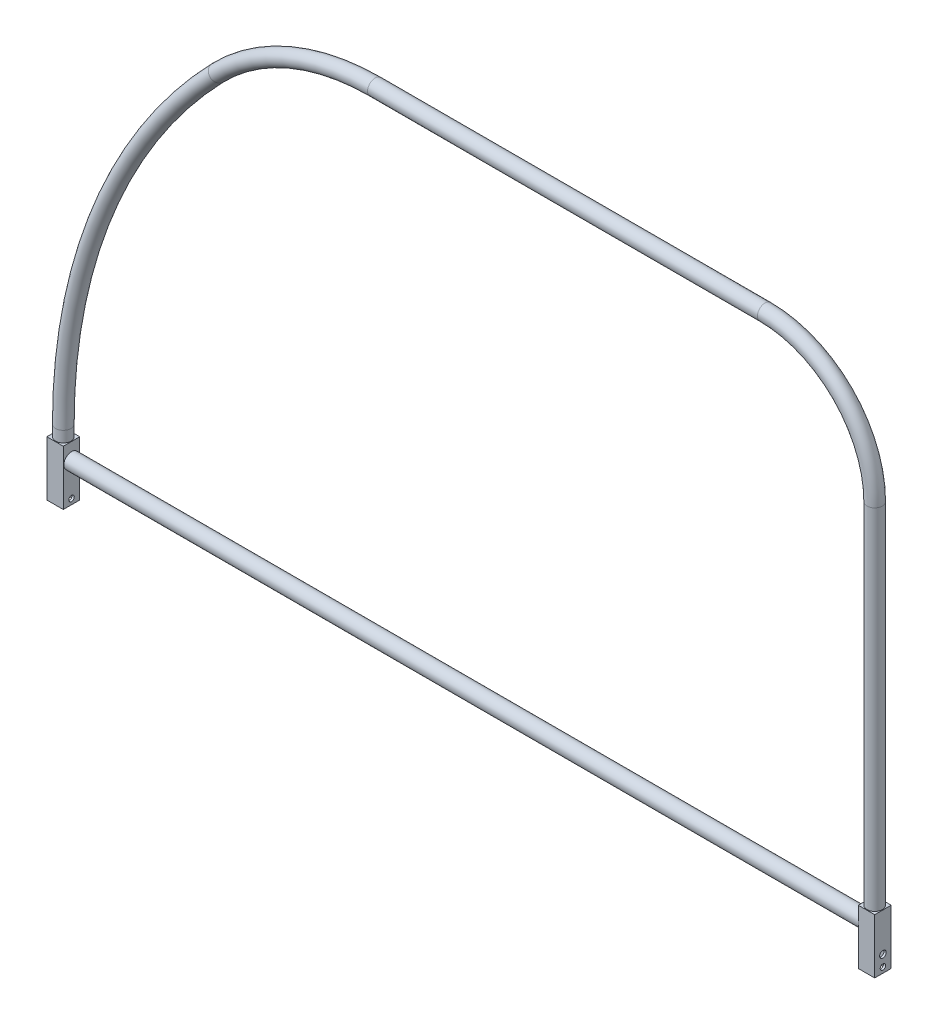
ISO-10303-21;
HEADER;
FILE_DESCRIPTION(('STEP AP214'),'2;1');
FILE_NAME('part.step','',(''),(''),'','','');
FILE_SCHEMA(('AUTOMOTIVE_DESIGN { 1 0 10303 214 1 1 1 1 }'));
ENDSEC;
DATA;
#1=APPLICATION_CONTEXT('core data for automotive mechanical design processes');
#2=APPLICATION_PROTOCOL_DEFINITION('international standard','automotive_design',2000,#1);
#3=PRODUCT_CONTEXT('',#1,'mechanical');
#4=PRODUCT('Part','Part','',(#3));
#5=PRODUCT_RELATED_PRODUCT_CATEGORY('part','',(#4));
#6=PRODUCT_DEFINITION_FORMATION('','',#4);
#7=PRODUCT_DEFINITION_CONTEXT('part definition',#1,'design');
#8=PRODUCT_DEFINITION('design','',#6,#7);
#9=PRODUCT_DEFINITION_SHAPE('','',#8);
#10=(LENGTH_UNIT() NAMED_UNIT(*) SI_UNIT(.MILLI.,.METRE.));
#11=(NAMED_UNIT(*) PLANE_ANGLE_UNIT() SI_UNIT($,.RADIAN.));
#12=(NAMED_UNIT(*) SI_UNIT($,.STERADIAN.) SOLID_ANGLE_UNIT());
#13=UNCERTAINTY_MEASURE_WITH_UNIT(LENGTH_MEASURE(1.E-05),#10,'distance_accuracy_value','');
#14=(GEOMETRIC_REPRESENTATION_CONTEXT(3) GLOBAL_UNCERTAINTY_ASSIGNED_CONTEXT((#13)) GLOBAL_UNIT_ASSIGNED_CONTEXT((#10,
#11,#12)) REPRESENTATION_CONTEXT('',''));
#15=CARTESIAN_POINT('',(0.,0.,0.));
#16=DIRECTION('',(0.,0.,1.));
#17=DIRECTION('',(1.,0.,0.));
#18=AXIS2_PLACEMENT_3D('',#15,#16,#17);
#19=CARTESIAN_POINT('',(0.,-63.5,0.));
#20=DIRECTION('',(0.,1.,0.));
#21=DIRECTION('',(0.,0.,1.));
#22=AXIS2_PLACEMENT_3D('',#19,#20,#21);
#23=PLANE('',#22);
#24=DIRECTION('',(0.,0.,-1.));
#25=VECTOR('',#24,1.);
#26=CARTESIAN_POINT('',(-9.525,-63.5,9.525));
#27=LINE('',#26,#25);
#28=CARTESIAN_POINT('',(-9.525,-63.5,9.525));
#29=VERTEX_POINT('',#28);
#30=CARTESIAN_POINT('',(-9.525,-63.5,-9.525));
#31=VERTEX_POINT('',#30);
#32=EDGE_CURVE('E335',#29,#31,#27,.T.);
#33=ORIENTED_EDGE('',*,*,#32,.T.);
#34=DIRECTION('',(1.,0.,0.));
#35=VECTOR('',#34,1.);
#36=CARTESIAN_POINT('',(9.525,-63.5,-9.525));
#37=LINE('',#36,#35);
#38=CARTESIAN_POINT('',(9.525,-63.5,-9.525));
#39=VERTEX_POINT('',#38);
#40=EDGE_CURVE('E339',#31,#39,#37,.T.);
#41=ORIENTED_EDGE('',*,*,#40,.T.);
#42=DIRECTION('',(0.,0.,1.));
#43=VECTOR('',#42,1.);
#44=CARTESIAN_POINT('',(9.525,-63.5,9.525));
#45=LINE('',#44,#43);
#46=CARTESIAN_POINT('',(9.525,-63.5,9.525));
#47=VERTEX_POINT('',#46);
#48=EDGE_CURVE('E343',#39,#47,#45,.T.);
#49=ORIENTED_EDGE('',*,*,#48,.T.);
#50=DIRECTION('',(-1.,0.,0.));
#51=VECTOR('',#50,1.);
#52=CARTESIAN_POINT('',(9.525,-63.5,9.525));
#53=LINE('',#52,#51);
#54=EDGE_CURVE('E346',#47,#29,#53,.T.);
#55=ORIENTED_EDGE('',*,*,#54,.T.);
#56=EDGE_LOOP('',(#33,#41,#49,#55));
#57=FACE_BOUND('',#56,.T.);
#58=DIRECTION('',(0.,0.,-1.));
#59=VECTOR('',#58,1.);
#60=CARTESIAN_POINT('',(-6.985,-63.5,0.));
#61=LINE('',#60,#59);
#62=CARTESIAN_POINT('',(-6.985,-63.5,6.985));
#63=VERTEX_POINT('',#62);
#64=CARTESIAN_POINT('',(-6.985,-63.5,-6.985));
#65=VERTEX_POINT('',#64);
#66=EDGE_CURVE('E268',#63,#65,#61,.T.);
#67=ORIENTED_EDGE('',*,*,#66,.F.);
#68=DIRECTION('',(-1.,0.,0.));
#69=VECTOR('',#68,1.);
#70=CARTESIAN_POINT('',(0.,-63.5,6.985));
#71=LINE('',#70,#69);
#72=CARTESIAN_POINT('',(6.985,-63.5,6.985));
#73=VERTEX_POINT('',#72);
#74=EDGE_CURVE('E265',#73,#63,#71,.T.);
#75=ORIENTED_EDGE('',*,*,#74,.F.);
#76=DIRECTION('',(0.,0.,1.));
#77=VECTOR('',#76,1.);
#78=CARTESIAN_POINT('',(6.985,-63.5,0.));
#79=LINE('',#78,#77);
#80=CARTESIAN_POINT('',(6.985,-63.5,-6.985));
#81=VERTEX_POINT('',#80);
#82=EDGE_CURVE('E279',#81,#73,#79,.T.);
#83=ORIENTED_EDGE('',*,*,#82,.F.);
#84=DIRECTION('',(1.,0.,0.));
#85=VECTOR('',#84,1.);
#86=CARTESIAN_POINT('',(0.,-63.5,-6.985));
#87=LINE('',#86,#85);
#88=EDGE_CURVE('E282',#65,#81,#87,.T.);
#89=ORIENTED_EDGE('',*,*,#88,.F.);
#90=EDGE_LOOP('',(#67,#75,#83,#89));
#91=FACE_BOUND('',#90,.T.);
#92=ADVANCED_FACE('F68',(#57,#91),#23,.F.);
#93=CARTESIAN_POINT('',(0.,-63.5,0.));
#94=DIRECTION('',(0.,1.,0.));
#95=DIRECTION('',(0.,0.,1.));
#96=AXIS2_PLACEMENT_3D('',#93,#94,#95);
#97=PLANE('',#96);
#98=DIRECTION('',(0.,0.,-1.));
#99=VECTOR('',#98,1.);
#100=CARTESIAN_POINT('',(930.275,-63.5,9.52500000000001));
#101=LINE('',#100,#99);
#102=CARTESIAN_POINT('',(930.275,-63.5,9.52500000000001));
#103=VERTEX_POINT('',#102);
#104=CARTESIAN_POINT('',(930.275,-63.5,-9.52500000000001));
#105=VERTEX_POINT('',#104);
#106=EDGE_CURVE('E293',#103,#105,#101,.T.);
#107=ORIENTED_EDGE('',*,*,#106,.T.);
#108=DIRECTION('',(1.,0.,0.));
#109=VECTOR('',#108,1.);
#110=CARTESIAN_POINT('',(949.325,-63.5,-9.525));
#111=LINE('',#110,#109);
#112=CARTESIAN_POINT('',(949.325,-63.5,-9.525));
#113=VERTEX_POINT('',#112);
#114=EDGE_CURVE('E297',#105,#113,#111,.T.);
#115=ORIENTED_EDGE('',*,*,#114,.T.);
#116=DIRECTION('',(0.,0.,1.));
#117=VECTOR('',#116,1.);
#118=CARTESIAN_POINT('',(949.325,-63.5,9.52500000000001));
#119=LINE('',#118,#117);
#120=CARTESIAN_POINT('',(949.325,-63.5,9.52500000000001));
#121=VERTEX_POINT('',#120);
#122=EDGE_CURVE('E301',#113,#121,#119,.T.);
#123=ORIENTED_EDGE('',*,*,#122,.T.);
#124=DIRECTION('',(-1.,0.,0.));
#125=VECTOR('',#124,1.);
#126=CARTESIAN_POINT('',(949.325,-63.5,9.52500000000001));
#127=LINE('',#126,#125);
#128=EDGE_CURVE('E304',#121,#103,#127,.T.);
#129=ORIENTED_EDGE('',*,*,#128,.T.);
#130=EDGE_LOOP('',(#107,#115,#123,#129));
#131=FACE_BOUND('',#130,.T.);
#132=DIRECTION('',(0.,0.,-1.));
#133=VECTOR('',#132,1.);
#134=CARTESIAN_POINT('',(932.815,-63.5,0.));
#135=LINE('',#134,#133);
#136=CARTESIAN_POINT('',(932.815,-63.5,6.985));
#137=VERTEX_POINT('',#136);
#138=CARTESIAN_POINT('',(932.815,-63.5,-6.985));
#139=VERTEX_POINT('',#138);
#140=EDGE_CURVE('E193',#137,#139,#135,.T.);
#141=ORIENTED_EDGE('',*,*,#140,.F.);
#142=DIRECTION('',(-1.,0.,0.));
#143=VECTOR('',#142,1.);
#144=CARTESIAN_POINT('',(0.,-63.5,6.98499999999992));
#145=LINE('',#144,#143);
#146=CARTESIAN_POINT('',(946.785,-63.5,6.98500000000001));
#147=VERTEX_POINT('',#146);
#148=EDGE_CURVE('E199',#147,#137,#145,.T.);
#149=ORIENTED_EDGE('',*,*,#148,.F.);
#150=DIRECTION('',(0.,0.,1.));
#151=VECTOR('',#150,1.);
#152=CARTESIAN_POINT('',(946.785,-63.5,0.));
#153=LINE('',#152,#151);
#154=CARTESIAN_POINT('',(946.785,-63.5,-6.985));
#155=VERTEX_POINT('',#154);
#156=EDGE_CURVE('E274',#155,#147,#153,.T.);
#157=ORIENTED_EDGE('',*,*,#156,.F.);
#158=DIRECTION('',(1.,0.,0.));
#159=VECTOR('',#158,1.);
#160=CARTESIAN_POINT('',(0.,-63.5,-6.98500000000009));
#161=LINE('',#160,#159);
#162=EDGE_CURVE('E271',#139,#155,#161,.T.);
#163=ORIENTED_EDGE('',*,*,#162,.F.);
#164=EDGE_LOOP('',(#141,#149,#157,#163));
#165=FACE_BOUND('',#164,.T.);
#166=ADVANCED_FACE('F430',(#131,#165),#97,.F.);
#167=CARTESIAN_POINT('',(0.,0.,0.));
#168=DIRECTION('',(0.,1.,0.));
#169=DIRECTION('',(0.,0.,1.));
#170=AXIS2_PLACEMENT_3D('',#167,#168,#169);
#171=CYLINDRICAL_SURFACE('',#170,8.88999999999995);
#172=CARTESIAN_POINT('',(0.,12.7,0.));
#173=DIRECTION('',(0.,-1.,0.));
#174=DIRECTION('',(0.,0.,1.));
#175=AXIS2_PLACEMENT_3D('',#172,#173,#174);
#176=CIRCLE('',#175,8.88999999999995);
#177=CARTESIAN_POINT('',(-8.88999999999984,12.7,0.));
#178=VERTEX_POINT('',#177);
#179=EDGE_CURVE('E381',#178,#178,#176,.T.);
#180=ORIENTED_EDGE('',*,*,#179,.T.);
#181=EDGE_LOOP('',(#180));
#182=FACE_BOUND('',#181,.T.);
#183=CARTESIAN_POINT('',(0.,0.,0.));
#184=DIRECTION('',(0.,-1.,0.));
#185=DIRECTION('',(0.,0.,1.));
#186=AXIS2_PLACEMENT_3D('',#183,#184,#185);
#187=CIRCLE('',#186,8.88999999999995);
#188=CARTESIAN_POINT('',(0.,0.,8.88999999999995));
#189=VERTEX_POINT('',#188);
#190=EDGE_CURVE('E377',#189,#189,#187,.T.);
#191=ORIENTED_EDGE('',*,*,#190,.F.);
#192=EDGE_LOOP('',(#191));
#193=FACE_BOUND('',#192,.T.);
#194=ADVANCED_FACE('F433',(#182,#193),#171,.T.);
#195=CARTESIAN_POINT('',(635.,12.7,0.));
#196=DIRECTION('',(0.,0.,-1.));
#197=DIRECTION('',(-1.,0.,0.));
#198=AXIS2_PLACEMENT_3D('',#195,#196,#197);
#199=TOROIDAL_SURFACE('',#198,635.,8.88999999999995);
#200=CARTESIAN_POINT('',(178.877192157063,454.488392972785,0.));
#201=DIRECTION('',(-0.695729752713046,-0.718303634398325,0.));
#202=DIRECTION('',(0.,0.,1.));
#203=AXIS2_PLACEMENT_3D('',#200,#201,#202);
#204=CIRCLE('',#203,8.88999999999995);
#205=CARTESIAN_POINT('',(172.491472847262,460.673430474403,0.));
#206=VERTEX_POINT('',#205);
#207=EDGE_CURVE('E385',#206,#206,#204,.T.);
#208=CARTESIAN_POINT('',(635.,12.7,0.));
#209=DIRECTION('',(0.,0.,-1.));
#210=DIRECTION('',(-1.,0.,0.));
#211=AXIS2_PLACEMENT_3D('',#208,#209,#210);
#212=CIRCLE('',#211,643.89);
#213=EDGE_CURVE('',#178,#206,#212,.T.);
#214=ORIENTED_EDGE('',*,*,#179,.F.);
#215=ORIENTED_EDGE('',*,*,#207,.T.);
#216=ORIENTED_EDGE('',*,*,#213,.T.);
#217=ORIENTED_EDGE('',*,*,#213,.F.);
#218=EDGE_LOOP('',(#214,#216,#215,#217));
#219=FACE_BOUND('',#218,.T.);
#220=ADVANCED_FACE('F484',(#219),#199,.T.);
#221=CARTESIAN_POINT('',(361.326315294238,277.773035783671,0.));
#222=DIRECTION('',(0.,0.,-1.));
#223=DIRECTION('',(-1.,0.,0.));
#224=AXIS2_PLACEMENT_3D('',#221,#222,#223);
#225=TOROIDAL_SURFACE('',#224,254.,8.88999999999995);
#226=CARTESIAN_POINT('',(361.326315294238,531.773035783671,0.));
#227=DIRECTION('',(-1.,0.,0.));
#228=DIRECTION('',(0.,0.,1.));
#229=AXIS2_PLACEMENT_3D('',#226,#227,#228);
#230=CIRCLE('',#229,8.88999999999995);
#231=CARTESIAN_POINT('',(361.326315294238,540.663035783671,0.));
#232=VERTEX_POINT('',#231);
#233=EDGE_CURVE('E389',#232,#232,#230,.T.);
#234=CARTESIAN_POINT('',(361.326315294238,277.773035783671,0.));
#235=DIRECTION('',(0.,0.,-1.));
#236=DIRECTION('',(-1.,0.,0.));
#237=AXIS2_PLACEMENT_3D('',#234,#235,#236);
#238=CIRCLE('',#237,262.89);
#239=EDGE_CURVE('',#206,#232,#238,.T.);
#240=ORIENTED_EDGE('',*,*,#207,.F.);
#241=ORIENTED_EDGE('',*,*,#233,.T.);
#242=ORIENTED_EDGE('',*,*,#239,.T.);
#243=ORIENTED_EDGE('',*,*,#239,.F.);
#244=EDGE_LOOP('',(#240,#242,#241,#243));
#245=FACE_BOUND('',#244,.T.);
#246=ADVANCED_FACE('F488',(#245),#225,.T.);
#247=CARTESIAN_POINT('',(361.326315294238,531.773035783671,0.));
#248=DIRECTION('',(1.,0.,0.));
#249=DIRECTION('',(0.,0.,-1.));
#250=AXIS2_PLACEMENT_3D('',#247,#248,#249);
#251=CYLINDRICAL_SURFACE('',#250,8.88999999999995);
#252=CARTESIAN_POINT('',(812.8,531.773035783671,0.));
#253=DIRECTION('',(-1.,0.,0.));
#254=DIRECTION('',(0.,0.,1.));
#255=AXIS2_PLACEMENT_3D('',#252,#253,#254);
#256=CIRCLE('',#255,8.88999999999995);
#257=CARTESIAN_POINT('',(812.8,540.663035783671,0.));
#258=VERTEX_POINT('',#257);
#259=EDGE_CURVE('E393',#258,#258,#256,.T.);
#260=ORIENTED_EDGE('',*,*,#259,.T.);
#261=EDGE_LOOP('',(#260));
#262=FACE_BOUND('',#261,.T.);
#263=ORIENTED_EDGE('',*,*,#233,.F.);
#264=EDGE_LOOP('',(#263));
#265=FACE_BOUND('',#264,.T.);
#266=ADVANCED_FACE('F492',(#262,#265),#251,.T.);
#267=CARTESIAN_POINT('',(812.8,404.773035783671,0.));
#268=DIRECTION('',(0.,0.,-1.));
#269=DIRECTION('',(-1.,0.,0.));
#270=AXIS2_PLACEMENT_3D('',#267,#268,#269);
#271=TOROIDAL_SURFACE('',#270,127.,8.88999999999995);
#272=CARTESIAN_POINT('',(939.8,404.773035783671,0.));
#273=DIRECTION('',(0.,1.,0.));
#274=DIRECTION('',(0.,0.,1.));
#275=AXIS2_PLACEMENT_3D('',#272,#273,#274);
#276=CIRCLE('',#275,8.88999999999995);
#277=CARTESIAN_POINT('',(948.69,404.773035783671,0.));
#278=VERTEX_POINT('',#277);
#279=EDGE_CURVE('E78',#278,#278,#276,.T.);
#280=CARTESIAN_POINT('',(812.8,404.773035783671,0.));
#281=DIRECTION('',(0.,0.,-1.));
#282=DIRECTION('',(-1.,0.,0.));
#283=AXIS2_PLACEMENT_3D('',#280,#281,#282);
#284=CIRCLE('',#283,135.89);
#285=EDGE_CURVE('',#258,#278,#284,.T.);
#286=ORIENTED_EDGE('',*,*,#259,.F.);
#287=ORIENTED_EDGE('',*,*,#279,.T.);
#288=ORIENTED_EDGE('',*,*,#285,.T.);
#289=ORIENTED_EDGE('',*,*,#285,.F.);
#290=EDGE_LOOP('',(#286,#288,#287,#289));
#291=FACE_BOUND('',#290,.T.);
#292=ADVANCED_FACE('F495',(#291),#271,.T.);
#293=CARTESIAN_POINT('',(939.8,404.773035783671,0.));
#294=DIRECTION('',(0.,-1.,0.));
#295=DIRECTION('',(0.,0.,-1.));
#296=AXIS2_PLACEMENT_3D('',#293,#294,#295);
#297=CYLINDRICAL_SURFACE('',#296,8.88999999999995);
#298=CARTESIAN_POINT('',(939.8,0.,0.));
#299=DIRECTION('',(0.,1.,0.));
#300=DIRECTION('',(0.,0.,1.));
#301=AXIS2_PLACEMENT_3D('',#298,#299,#300);
#302=CIRCLE('',#301,8.88999999999995);
#303=CARTESIAN_POINT('',(939.8,0.,8.88999999999995));
#304=VERTEX_POINT('',#303);
#305=EDGE_CURVE('E334',#304,#304,#302,.T.);
#306=ORIENTED_EDGE('',*,*,#305,.T.);
#307=EDGE_LOOP('',(#306));
#308=FACE_BOUND('',#307,.T.);
#309=ORIENTED_EDGE('',*,*,#279,.F.);
#310=EDGE_LOOP('',(#309));
#311=FACE_BOUND('',#310,.T.);
#312=ADVANCED_FACE('F70',(#308,#311),#297,.T.);
#313=CARTESIAN_POINT('',(-9.525,-63.5,9.525));
#314=DIRECTION('',(1.,0.,0.));
#315=DIRECTION('',(0.,0.,-1.));
#316=AXIS2_PLACEMENT_3D('',#313,#314,#315);
#317=PLANE('',#316);
#318=CARTESIAN_POINT('',(-9.525,-44.45,0.));
#319=DIRECTION('',(-1.,0.,0.));
#320=DIRECTION('',(0.,0.,1.));
#321=AXIS2_PLACEMENT_3D('',#318,#319,#320);
#322=CIRCLE('',#321,3.81);
#323=CARTESIAN_POINT('',(-9.525,-44.45,3.81));
#324=VERTEX_POINT('',#323);
#325=EDGE_CURVE('E947',#324,#324,#322,.T.);
#326=ORIENTED_EDGE('',*,*,#325,.F.);
#327=EDGE_LOOP('',(#326));
#328=FACE_BOUND('',#327,.T.);
#329=CARTESIAN_POINT('',(-9.525,-57.15,0.));
#330=DIRECTION('',(-1.,0.,0.));
#331=DIRECTION('',(0.,0.,1.));
#332=AXIS2_PLACEMENT_3D('',#329,#330,#331);
#333=CIRCLE('',#332,3.175);
#334=CARTESIAN_POINT('',(-9.525,-57.15,3.17499999999999));
#335=VERTEX_POINT('',#334);
#336=EDGE_CURVE('E958',#335,#335,#333,.T.);
#337=ORIENTED_EDGE('',*,*,#336,.F.);
#338=EDGE_LOOP('',(#337));
#339=FACE_BOUND('',#338,.T.);
#340=DIRECTION('',(0.,0.,-1.));
#341=VECTOR('',#340,1.);
#342=CARTESIAN_POINT('',(-9.525,0.,9.525));
#343=LINE('',#342,#341);
#344=CARTESIAN_POINT('',(-9.525,0.,9.525));
#345=VERTEX_POINT('',#344);
#346=CARTESIAN_POINT('',(-9.525,0.,-9.525));
#347=VERTEX_POINT('',#346);
#348=EDGE_CURVE('E350',#345,#347,#343,.T.);
#349=ORIENTED_EDGE('',*,*,#348,.T.);
#350=DIRECTION('',(0.,1.,0.));
#351=VECTOR('',#350,1.);
#352=CARTESIAN_POINT('',(-9.525,-63.5,-9.525));
#353=LINE('',#352,#351);
#354=EDGE_CURVE('E373',#31,#347,#353,.T.);
#355=ORIENTED_EDGE('',*,*,#354,.F.);
#356=ORIENTED_EDGE('',*,*,#32,.F.);
#357=DIRECTION('',(0.,1.,0.));
#358=VECTOR('',#357,1.);
#359=CARTESIAN_POINT('',(-9.525,-63.5,9.525));
#360=LINE('',#359,#358);
#361=EDGE_CURVE('E349',#29,#345,#360,.T.);
#362=ORIENTED_EDGE('',*,*,#361,.T.);
#363=EDGE_LOOP('',(#349,#355,#356,#362));
#364=FACE_BOUND('',#363,.T.);
#365=ADVANCED_FACE('F477',(#328,#339,#364),#317,.F.);
#366=CARTESIAN_POINT('',(9.525,-63.5,-9.525));
#367=DIRECTION('',(0.,0.,1.));
#368=DIRECTION('',(1.,0.,0.));
#369=AXIS2_PLACEMENT_3D('',#366,#367,#368);
#370=PLANE('',#369);
#371=DIRECTION('',(1.,0.,0.));
#372=VECTOR('',#371,1.);
#373=CARTESIAN_POINT('',(9.525,0.,-9.525));
#374=LINE('',#373,#372);
#375=CARTESIAN_POINT('',(9.525,0.,-9.525));
#376=VERTEX_POINT('',#375);
#377=EDGE_CURVE('E354',#347,#376,#374,.T.);
#378=ORIENTED_EDGE('',*,*,#377,.T.);
#379=DIRECTION('',(0.,1.,0.));
#380=VECTOR('',#379,1.);
#381=CARTESIAN_POINT('',(9.525,-63.5,-9.525));
#382=LINE('',#381,#380);
#383=EDGE_CURVE('E369',#39,#376,#382,.T.);
#384=ORIENTED_EDGE('',*,*,#383,.F.);
#385=ORIENTED_EDGE('',*,*,#40,.F.);
#386=ORIENTED_EDGE('',*,*,#354,.T.);
#387=EDGE_LOOP('',(#378,#384,#385,#386));
#388=FACE_BOUND('',#387,.T.);
#389=ADVANCED_FACE('F473',(#388),#370,.F.);
#390=CARTESIAN_POINT('',(9.525,-63.5,9.525));
#391=DIRECTION('',(-1.,0.,0.));
#392=DIRECTION('',(0.,0.,1.));
#393=AXIS2_PLACEMENT_3D('',#390,#391,#392);
#394=PLANE('',#393);
#395=CARTESIAN_POINT('',(9.52500000000001,-57.15,0.));
#396=DIRECTION('',(-1.,0.,0.));
#397=DIRECTION('',(0.,0.,1.));
#398=AXIS2_PLACEMENT_3D('',#395,#396,#397);
#399=CIRCLE('',#398,3.175);
#400=CARTESIAN_POINT('',(9.52500000000001,-57.15,3.175));
#401=VERTEX_POINT('',#400);
#402=EDGE_CURVE('E217',#401,#401,#399,.T.);
#403=ORIENTED_EDGE('',*,*,#402,.T.);
#404=EDGE_LOOP('',(#403));
#405=FACE_BOUND('',#404,.T.);
#406=CARTESIAN_POINT('',(9.525,-19.05,0.));
#407=DIRECTION('',(1.,0.,0.));
#408=DIRECTION('',(0.,0.,-1.));
#409=AXIS2_PLACEMENT_3D('',#406,#407,#408);
#410=CIRCLE('',#409,8.89);
#411=CARTESIAN_POINT('',(9.525,-19.05,-8.89));
#412=VERTEX_POINT('',#411);
#413=EDGE_CURVE('E14',#412,#412,#410,.T.);
#414=ORIENTED_EDGE('',*,*,#413,.F.);
#415=EDGE_LOOP('',(#414));
#416=FACE_BOUND('',#415,.T.);
#417=DIRECTION('',(0.,0.,1.));
#418=VECTOR('',#417,1.);
#419=CARTESIAN_POINT('',(9.525,0.,9.525));
#420=LINE('',#419,#418);
#421=CARTESIAN_POINT('',(9.525,0.,9.525));
#422=VERTEX_POINT('',#421);
#423=EDGE_CURVE('E357',#376,#422,#420,.T.);
#424=ORIENTED_EDGE('',*,*,#423,.T.);
#425=DIRECTION('',(0.,1.,0.));
#426=VECTOR('',#425,1.);
#427=CARTESIAN_POINT('',(9.525,-63.5,9.525));
#428=LINE('',#427,#426);
#429=EDGE_CURVE('E365',#47,#422,#428,.T.);
#430=ORIENTED_EDGE('',*,*,#429,.F.);
#431=ORIENTED_EDGE('',*,*,#48,.F.);
#432=ORIENTED_EDGE('',*,*,#383,.T.);
#433=EDGE_LOOP('',(#424,#430,#431,#432));
#434=FACE_BOUND('',#433,.T.);
#435=ADVANCED_FACE('F469',(#405,#416,#434),#394,.F.);
#436=CARTESIAN_POINT('',(9.525,-63.5,9.525));
#437=DIRECTION('',(0.,0.,-1.));
#438=DIRECTION('',(-1.,0.,0.));
#439=AXIS2_PLACEMENT_3D('',#436,#437,#438);
#440=PLANE('',#439);
#441=DIRECTION('',(-1.,0.,0.));
#442=VECTOR('',#441,1.);
#443=CARTESIAN_POINT('',(9.525,0.,9.525));
#444=LINE('',#443,#442);
#445=EDGE_CURVE('E340',#422,#345,#444,.T.);
#446=ORIENTED_EDGE('',*,*,#445,.T.);
#447=ORIENTED_EDGE('',*,*,#361,.F.);
#448=ORIENTED_EDGE('',*,*,#54,.F.);
#449=ORIENTED_EDGE('',*,*,#429,.T.);
#450=EDGE_LOOP('',(#446,#447,#448,#449));
#451=FACE_BOUND('',#450,.T.);
#452=ADVANCED_FACE('F465',(#451),#440,.F.);
#453=CARTESIAN_POINT('',(0.,0.,0.));
#454=DIRECTION('',(0.,1.,0.));
#455=DIRECTION('',(0.,0.,1.));
#456=AXIS2_PLACEMENT_3D('',#453,#454,#455);
#457=PLANE('',#456);
#458=ORIENTED_EDGE('',*,*,#190,.T.);
#459=EDGE_LOOP('',(#458));
#460=FACE_BOUND('',#459,.T.);
#461=ORIENTED_EDGE('',*,*,#348,.F.);
#462=ORIENTED_EDGE('',*,*,#445,.F.);
#463=ORIENTED_EDGE('',*,*,#423,.F.);
#464=ORIENTED_EDGE('',*,*,#377,.F.);
#465=EDGE_LOOP('',(#461,#462,#463,#464));
#466=FACE_BOUND('',#465,.T.);
#467=ADVANCED_FACE('F462',(#460,#466),#457,.T.);
#468=CARTESIAN_POINT('',(930.275,-63.5,9.52500000000001));
#469=DIRECTION('',(1.,0.,0.));
#470=DIRECTION('',(0.,0.,-1.));
#471=AXIS2_PLACEMENT_3D('',#468,#469,#470);
#472=PLANE('',#471);
#473=CARTESIAN_POINT('',(930.275,-57.15,1.41765457397882E-13));
#474=DIRECTION('',(1.,0.,0.));
#475=DIRECTION('',(0.,0.,-1.));
#476=AXIS2_PLACEMENT_3D('',#473,#474,#475);
#477=CIRCLE('',#476,3.175);
#478=CARTESIAN_POINT('',(930.275,-57.15,-3.17499999999985));
#479=VERTEX_POINT('',#478);
#480=EDGE_CURVE('E981',#479,#479,#477,.T.);
#481=ORIENTED_EDGE('',*,*,#480,.T.);
#482=EDGE_LOOP('',(#481));
#483=FACE_BOUND('',#482,.T.);
#484=CARTESIAN_POINT('',(930.275,-19.05,0.));
#485=DIRECTION('',(1.,0.,0.));
#486=DIRECTION('',(0.,0.,-1.));
#487=AXIS2_PLACEMENT_3D('',#484,#485,#486);
#488=CIRCLE('',#487,8.89);
#489=CARTESIAN_POINT('',(930.275,-19.05,-8.89));
#490=VERTEX_POINT('',#489);
#491=EDGE_CURVE('E237',#490,#490,#488,.T.);
#492=ORIENTED_EDGE('',*,*,#491,.T.);
#493=EDGE_LOOP('',(#492));
#494=FACE_BOUND('',#493,.T.);
#495=DIRECTION('',(0.,0.,-1.));
#496=VECTOR('',#495,1.);
#497=CARTESIAN_POINT('',(930.275,0.,9.52500000000001));
#498=LINE('',#497,#496);
#499=CARTESIAN_POINT('',(930.275,0.,9.52500000000001));
#500=VERTEX_POINT('',#499);
#501=CARTESIAN_POINT('',(930.275,0.,-9.52500000000001));
#502=VERTEX_POINT('',#501);
#503=EDGE_CURVE('E292',#500,#502,#498,.T.);
#504=ORIENTED_EDGE('',*,*,#503,.T.);
#505=DIRECTION('',(0.,1.,0.));
#506=VECTOR('',#505,1.);
#507=CARTESIAN_POINT('',(930.275,-63.5,-9.52500000000001));
#508=LINE('',#507,#506);
#509=EDGE_CURVE('E330',#105,#502,#508,.T.);
#510=ORIENTED_EDGE('',*,*,#509,.F.);
#511=ORIENTED_EDGE('',*,*,#106,.F.);
#512=DIRECTION('',(0.,1.,0.));
#513=VECTOR('',#512,1.);
#514=CARTESIAN_POINT('',(930.275,-63.5,9.52500000000001));
#515=LINE('',#514,#513);
#516=EDGE_CURVE('E307',#103,#500,#515,.T.);
#517=ORIENTED_EDGE('',*,*,#516,.T.);
#518=EDGE_LOOP('',(#504,#510,#511,#517));
#519=FACE_BOUND('',#518,.T.);
#520=ADVANCED_FACE('F417',(#483,#494,#519),#472,.F.);
#521=CARTESIAN_POINT('',(949.325,-63.5,-9.525));
#522=DIRECTION('',(0.,0.,1.));
#523=DIRECTION('',(1.,0.,0.));
#524=AXIS2_PLACEMENT_3D('',#521,#522,#523);
#525=PLANE('',#524);
#526=DIRECTION('',(1.,0.,0.));
#527=VECTOR('',#526,1.);
#528=CARTESIAN_POINT('',(949.325,0.,-9.525));
#529=LINE('',#528,#527);
#530=CARTESIAN_POINT('',(949.325,0.,-9.525));
#531=VERTEX_POINT('',#530);
#532=EDGE_CURVE('E311',#502,#531,#529,.T.);
#533=ORIENTED_EDGE('',*,*,#532,.T.);
#534=DIRECTION('',(0.,1.,0.));
#535=VECTOR('',#534,1.);
#536=CARTESIAN_POINT('',(949.325,-63.5,-9.525));
#537=LINE('',#536,#535);
#538=EDGE_CURVE('E326',#113,#531,#537,.T.);
#539=ORIENTED_EDGE('',*,*,#538,.F.);
#540=ORIENTED_EDGE('',*,*,#114,.F.);
#541=ORIENTED_EDGE('',*,*,#509,.T.);
#542=EDGE_LOOP('',(#533,#539,#540,#541));
#543=FACE_BOUND('',#542,.T.);
#544=ADVANCED_FACE('F428',(#543),#525,.F.);
#545=CARTESIAN_POINT('',(949.325,-63.5,9.52500000000001));
#546=DIRECTION('',(-1.,0.,0.));
#547=DIRECTION('',(0.,0.,1.));
#548=AXIS2_PLACEMENT_3D('',#545,#546,#547);
#549=PLANE('',#548);
#550=CARTESIAN_POINT('',(949.325,-44.45,0.));
#551=DIRECTION('',(1.,0.,0.));
#552=DIRECTION('',(0.,0.,-1.));
#553=AXIS2_PLACEMENT_3D('',#550,#551,#552);
#554=CIRCLE('',#553,3.81);
#555=CARTESIAN_POINT('',(949.325,-44.45,-3.81));
#556=VERTEX_POINT('',#555);
#557=EDGE_CURVE('E952',#556,#556,#554,.T.);
#558=ORIENTED_EDGE('',*,*,#557,.F.);
#559=EDGE_LOOP('',(#558));
#560=FACE_BOUND('',#559,.T.);
#561=CARTESIAN_POINT('',(949.325,-57.15,1.44656663191177E-13));
#562=DIRECTION('',(-1.,0.,0.));
#563=DIRECTION('',(0.,0.,1.));
#564=AXIS2_PLACEMENT_3D('',#561,#562,#563);
#565=CIRCLE('',#564,3.175);
#566=CARTESIAN_POINT('',(949.325,-57.15,3.17500000000014));
#567=VERTEX_POINT('',#566);
#568=EDGE_CURVE('E962',#567,#567,#565,.T.);
#569=ORIENTED_EDGE('',*,*,#568,.T.);
#570=EDGE_LOOP('',(#569));
#571=FACE_BOUND('',#570,.T.);
#572=DIRECTION('',(0.,0.,1.));
#573=VECTOR('',#572,1.);
#574=CARTESIAN_POINT('',(949.325,0.,9.52500000000001));
#575=LINE('',#574,#573);
#576=CARTESIAN_POINT('',(949.325,0.,9.52500000000001));
#577=VERTEX_POINT('',#576);
#578=EDGE_CURVE('E314',#531,#577,#575,.T.);
#579=ORIENTED_EDGE('',*,*,#578,.T.);
#580=DIRECTION('',(0.,1.,0.));
#581=VECTOR('',#580,1.);
#582=CARTESIAN_POINT('',(949.325,-63.5,9.52500000000001));
#583=LINE('',#582,#581);
#584=EDGE_CURVE('E322',#121,#577,#583,.T.);
#585=ORIENTED_EDGE('',*,*,#584,.F.);
#586=ORIENTED_EDGE('',*,*,#122,.F.);
#587=ORIENTED_EDGE('',*,*,#538,.T.);
#588=EDGE_LOOP('',(#579,#585,#586,#587));
#589=FACE_BOUND('',#588,.T.);
#590=ADVANCED_FACE('F425',(#560,#571,#589),#549,.F.);
#591=CARTESIAN_POINT('',(949.325,-63.5,9.52500000000001));
#592=DIRECTION('',(0.,0.,-1.));
#593=DIRECTION('',(-1.,0.,0.));
#594=AXIS2_PLACEMENT_3D('',#591,#592,#593);
#595=PLANE('',#594);
#596=DIRECTION('',(-1.,0.,0.));
#597=VECTOR('',#596,1.);
#598=CARTESIAN_POINT('',(949.325,0.,9.52500000000001));
#599=LINE('',#598,#597);
#600=EDGE_CURVE('E298',#577,#500,#599,.T.);
#601=ORIENTED_EDGE('',*,*,#600,.T.);
#602=ORIENTED_EDGE('',*,*,#516,.F.);
#603=ORIENTED_EDGE('',*,*,#128,.F.);
#604=ORIENTED_EDGE('',*,*,#584,.T.);
#605=EDGE_LOOP('',(#601,#602,#603,#604));
#606=FACE_BOUND('',#605,.T.);
#607=ADVANCED_FACE('F410',(#606),#595,.F.);
#608=CARTESIAN_POINT('',(0.,0.,0.));
#609=DIRECTION('',(0.,1.,0.));
#610=DIRECTION('',(0.,0.,1.));
#611=AXIS2_PLACEMENT_3D('',#608,#609,#610);
#612=PLANE('',#611);
#613=ORIENTED_EDGE('',*,*,#305,.F.);
#614=EDGE_LOOP('',(#613));
#615=FACE_BOUND('',#614,.T.);
#616=ORIENTED_EDGE('',*,*,#503,.F.);
#617=ORIENTED_EDGE('',*,*,#600,.F.);
#618=ORIENTED_EDGE('',*,*,#578,.F.);
#619=ORIENTED_EDGE('',*,*,#532,.F.);
#620=EDGE_LOOP('',(#616,#617,#618,#619));
#621=FACE_BOUND('',#620,.T.);
#622=ADVANCED_FACE('F406',(#615,#621),#612,.T.);
#623=CARTESIAN_POINT('',(9.525,-19.05,0.));
#624=DIRECTION('',(1.,0.,0.));
#625=DIRECTION('',(0.,0.,-1.));
#626=AXIS2_PLACEMENT_3D('',#623,#624,#625);
#627=CYLINDRICAL_SURFACE('',#626,8.89);
#628=ORIENTED_EDGE('',*,*,#491,.F.);
#629=EDGE_LOOP('',(#628));
#630=FACE_BOUND('',#629,.T.);
#631=ORIENTED_EDGE('',*,*,#413,.T.);
#632=EDGE_LOOP('',(#631));
#633=FACE_BOUND('',#632,.T.);
#634=ADVANCED_FACE('F409',(#630,#633),#627,.T.);
#635=CARTESIAN_POINT('',(0.,0.,0.));
#636=DIRECTION('',(0.,1.,0.));
#637=DIRECTION('',(0.,0.,1.));
#638=AXIS2_PLACEMENT_3D('',#635,#636,#637);
#639=CYLINDRICAL_SURFACE('',#638,6.34999999999995);
#640=CARTESIAN_POINT('',(0.,12.7,0.));
#641=DIRECTION('',(0.,1.,0.));
#642=DIRECTION('',(0.,0.,1.));
#643=AXIS2_PLACEMENT_3D('',#640,#641,#642);
#644=CIRCLE('',#643,6.34999999999995);
#645=CARTESIAN_POINT('',(-6.34999999999986,12.7,0.));
#646=VERTEX_POINT('',#645);
#647=EDGE_CURVE('E988',#646,#646,#644,.F.);
#648=ORIENTED_EDGE('',*,*,#647,.F.);
#649=EDGE_LOOP('',(#648));
#650=FACE_BOUND('',#649,.T.);
#651=CARTESIAN_POINT('',(0.,-2.54,0.));
#652=DIRECTION('',(0.,1.,0.));
#653=DIRECTION('',(0.,0.,1.));
#654=AXIS2_PLACEMENT_3D('',#651,#652,#653);
#655=CIRCLE('',#654,6.34999999999995);
#656=CARTESIAN_POINT('',(0.,-2.54,6.34999999999995));
#657=VERTEX_POINT('',#656);
#658=EDGE_CURVE('E258',#657,#657,#655,.F.);
#659=ORIENTED_EDGE('',*,*,#658,.T.);
#660=EDGE_LOOP('',(#659));
#661=FACE_BOUND('',#660,.T.);
#662=ADVANCED_FACE('F582',(#650,#661),#639,.F.);
#663=CARTESIAN_POINT('',(635.,12.7,0.));
#664=DIRECTION('',(0.,0.,-1.));
#665=DIRECTION('',(-1.,0.,0.));
#666=AXIS2_PLACEMENT_3D('',#663,#664,#665);
#667=TOROIDAL_SURFACE('',#666,635.,6.34999999999995);
#668=CARTESIAN_POINT('',(178.877192157063,454.488392972785,0.));
#669=DIRECTION('',(-0.695729752713046,-0.718303634398325,0.));
#670=DIRECTION('',(0.718303634398325,-0.695729752713046,0.));
#671=AXIS2_PLACEMENT_3D('',#668,#669,#670);
#672=CIRCLE('',#671,6.34999999999995);
#673=CARTESIAN_POINT('',(174.315964078634,458.906276902512,0.));
#674=VERTEX_POINT('',#673);
#675=EDGE_CURVE('E992',#674,#674,#672,.T.);
#676=CARTESIAN_POINT('',(635.,12.7,0.));
#677=DIRECTION('',(0.,0.,-1.));
#678=DIRECTION('',(-1.,0.,0.));
#679=AXIS2_PLACEMENT_3D('',#676,#677,#678);
#680=CIRCLE('',#679,641.35);
#681=EDGE_CURVE('',#646,#674,#680,.T.);
#682=ORIENTED_EDGE('',*,*,#647,.T.);
#683=ORIENTED_EDGE('',*,*,#675,.F.);
#684=ORIENTED_EDGE('',*,*,#681,.T.);
#685=ORIENTED_EDGE('',*,*,#681,.F.);
#686=EDGE_LOOP('',(#682,#684,#683,#685));
#687=FACE_BOUND('',#686,.T.);
#688=ADVANCED_FACE('F591',(#687),#667,.F.);
#689=CARTESIAN_POINT('',(361.326315294238,277.773035783671,0.));
#690=DIRECTION('',(0.,0.,-1.));
#691=DIRECTION('',(-1.,0.,0.));
#692=AXIS2_PLACEMENT_3D('',#689,#690,#691);
#693=TOROIDAL_SURFACE('',#692,254.,6.34999999999995);
#694=CARTESIAN_POINT('',(361.326315294238,531.773035783671,0.));
#695=DIRECTION('',(-1.,0.,0.));
#696=DIRECTION('',(0.,-1.,0.));
#697=AXIS2_PLACEMENT_3D('',#694,#695,#696);
#698=CIRCLE('',#697,6.34999999999995);
#699=CARTESIAN_POINT('',(361.326315294238,538.123035783671,0.));
#700=VERTEX_POINT('',#699);
#701=EDGE_CURVE('E999',#700,#700,#698,.T.);
#702=CARTESIAN_POINT('',(361.326315294238,277.773035783671,0.));
#703=DIRECTION('',(0.,0.,-1.));
#704=DIRECTION('',(-1.,0.,0.));
#705=AXIS2_PLACEMENT_3D('',#702,#703,#704);
#706=CIRCLE('',#705,260.35);
#707=EDGE_CURVE('',#674,#700,#706,.T.);
#708=ORIENTED_EDGE('',*,*,#675,.T.);
#709=ORIENTED_EDGE('',*,*,#701,.F.);
#710=ORIENTED_EDGE('',*,*,#707,.T.);
#711=ORIENTED_EDGE('',*,*,#707,.F.);
#712=EDGE_LOOP('',(#708,#710,#709,#711));
#713=FACE_BOUND('',#712,.T.);
#714=ADVANCED_FACE('F600',(#713),#693,.F.);
#715=CARTESIAN_POINT('',(361.326315294238,531.773035783671,0.));
#716=DIRECTION('',(1.,0.,0.));
#717=DIRECTION('',(0.,0.,-1.));
#718=AXIS2_PLACEMENT_3D('',#715,#716,#717);
#719=CYLINDRICAL_SURFACE('',#718,6.34999999999995);
#720=CARTESIAN_POINT('',(812.8,531.773035783671,0.));
#721=DIRECTION('',(1.,0.,0.));
#722=DIRECTION('',(0.,0.,-1.));
#723=AXIS2_PLACEMENT_3D('',#720,#721,#722);
#724=CIRCLE('',#723,6.34999999999995);
#725=CARTESIAN_POINT('',(812.8,538.123035783671,0.));
#726=VERTEX_POINT('',#725);
#727=EDGE_CURVE('E1003',#726,#726,#724,.F.);
#728=ORIENTED_EDGE('',*,*,#727,.F.);
#729=EDGE_LOOP('',(#728));
#730=FACE_BOUND('',#729,.T.);
#731=ORIENTED_EDGE('',*,*,#701,.T.);
#732=EDGE_LOOP('',(#731));
#733=FACE_BOUND('',#732,.T.);
#734=ADVANCED_FACE('F608',(#730,#733),#719,.F.);
#735=CARTESIAN_POINT('',(812.8,404.773035783671,0.));
#736=DIRECTION('',(0.,0.,-1.));
#737=DIRECTION('',(-1.,0.,0.));
#738=AXIS2_PLACEMENT_3D('',#735,#736,#737);
#739=TOROIDAL_SURFACE('',#738,127.,6.34999999999995);
#740=CARTESIAN_POINT('',(939.8,404.773035783671,0.));
#741=DIRECTION('',(0.,1.,0.));
#742=DIRECTION('',(-1.,0.,0.));
#743=AXIS2_PLACEMENT_3D('',#740,#741,#742);
#744=CIRCLE('',#743,6.34999999999995);
#745=CARTESIAN_POINT('',(946.15,404.773035783671,0.));
#746=VERTEX_POINT('',#745);
#747=EDGE_CURVE('E238',#746,#746,#744,.T.);
#748=CARTESIAN_POINT('',(812.8,404.773035783671,0.));
#749=DIRECTION('',(0.,0.,-1.));
#750=DIRECTION('',(-1.,0.,0.));
#751=AXIS2_PLACEMENT_3D('',#748,#749,#750);
#752=CIRCLE('',#751,133.35);
#753=EDGE_CURVE('',#726,#746,#752,.T.);
#754=ORIENTED_EDGE('',*,*,#727,.T.);
#755=ORIENTED_EDGE('',*,*,#747,.F.);
#756=ORIENTED_EDGE('',*,*,#753,.T.);
#757=ORIENTED_EDGE('',*,*,#753,.F.);
#758=EDGE_LOOP('',(#754,#756,#755,#757));
#759=FACE_BOUND('',#758,.T.);
#760=ADVANCED_FACE('F616',(#759),#739,.F.);
#761=CARTESIAN_POINT('',(939.8,404.773035783671,0.));
#762=DIRECTION('',(0.,-1.,0.));
#763=DIRECTION('',(0.,0.,-1.));
#764=AXIS2_PLACEMENT_3D('',#761,#762,#763);
#765=CYLINDRICAL_SURFACE('',#764,6.34999999999995);
#766=CARTESIAN_POINT('',(939.8,-2.53999999999999,0.));
#767=DIRECTION('',(0.,1.,0.));
#768=DIRECTION('',(0.,0.,1.));
#769=AXIS2_PLACEMENT_3D('',#766,#767,#768);
#770=CIRCLE('',#769,6.34999999999995);
#771=CARTESIAN_POINT('',(939.8,-2.53999999999999,6.34999999999995));
#772=VERTEX_POINT('',#771);
#773=EDGE_CURVE('E220',#772,#772,#770,.T.);
#774=ORIENTED_EDGE('',*,*,#773,.F.);
#775=EDGE_LOOP('',(#774));
#776=FACE_BOUND('',#775,.T.);
#777=ORIENTED_EDGE('',*,*,#747,.T.);
#778=EDGE_LOOP('',(#777));
#779=FACE_BOUND('',#778,.T.);
#780=ADVANCED_FACE('F585',(#776,#779),#765,.F.);
#781=CARTESIAN_POINT('',(-6.985,-63.5,9.525));
#782=DIRECTION('',(1.,0.,0.));
#783=DIRECTION('',(0.,0.,-1.));
#784=AXIS2_PLACEMENT_3D('',#781,#782,#783);
#785=PLANE('',#784);
#786=CARTESIAN_POINT('',(-6.985,-44.45,0.));
#787=DIRECTION('',(-1.,0.,0.));
#788=DIRECTION('',(0.,0.,1.));
#789=AXIS2_PLACEMENT_3D('',#786,#787,#788);
#790=CIRCLE('',#789,3.81);
#791=CARTESIAN_POINT('',(-6.985,-44.45,3.81));
#792=VERTEX_POINT('',#791);
#793=EDGE_CURVE('E944',#792,#792,#790,.T.);
#794=ORIENTED_EDGE('',*,*,#793,.T.);
#795=EDGE_LOOP('',(#794));
#796=FACE_BOUND('',#795,.T.);
#797=CARTESIAN_POINT('',(-6.98500000000002,-57.15,0.));
#798=DIRECTION('',(1.,0.,0.));
#799=DIRECTION('',(0.,0.,-1.));
#800=AXIS2_PLACEMENT_3D('',#797,#798,#799);
#801=CIRCLE('',#800,3.175);
#802=CARTESIAN_POINT('',(-6.98500000000002,-57.15,-3.175));
#803=VERTEX_POINT('',#802);
#804=EDGE_CURVE('E977',#803,#803,#801,.T.);
#805=ORIENTED_EDGE('',*,*,#804,.F.);
#806=EDGE_LOOP('',(#805));
#807=FACE_BOUND('',#806,.T.);
#808=DIRECTION('',(0.,0.,-1.));
#809=VECTOR('',#808,1.);
#810=CARTESIAN_POINT('',(-6.985,-2.54,0.));
#811=LINE('',#810,#809);
#812=CARTESIAN_POINT('',(-6.985,-2.54,6.985));
#813=VERTEX_POINT('',#812);
#814=CARTESIAN_POINT('',(-6.985,-2.54,-6.985));
#815=VERTEX_POINT('',#814);
#816=EDGE_CURVE('E254',#813,#815,#811,.T.);
#817=ORIENTED_EDGE('',*,*,#816,.F.);
#818=DIRECTION('',(0.,1.,0.));
#819=VECTOR('',#818,1.);
#820=CARTESIAN_POINT('',(-6.985,-63.5,6.985));
#821=LINE('',#820,#819);
#822=EDGE_CURVE('E247',#63,#813,#821,.T.);
#823=ORIENTED_EDGE('',*,*,#822,.F.);
#824=ORIENTED_EDGE('',*,*,#66,.T.);
#825=DIRECTION('',(0.,1.,0.));
#826=VECTOR('',#825,1.);
#827=CARTESIAN_POINT('',(-6.985,-63.5,-6.985));
#828=LINE('',#827,#826);
#829=EDGE_CURVE('E251',#65,#815,#828,.T.);
#830=ORIENTED_EDGE('',*,*,#829,.T.);
#831=EDGE_LOOP('',(#817,#823,#824,#830));
#832=FACE_BOUND('',#831,.T.);
#833=ADVANCED_FACE('F594',(#796,#807,#832),#785,.T.);
#834=CARTESIAN_POINT('',(9.525,-63.5,-6.985));
#835=DIRECTION('',(0.,0.,1.));
#836=DIRECTION('',(1.,0.,0.));
#837=AXIS2_PLACEMENT_3D('',#834,#835,#836);
#838=PLANE('',#837);
#839=DIRECTION('',(1.,0.,0.));
#840=VECTOR('',#839,1.);
#841=CARTESIAN_POINT('',(0.,-2.54,-6.985));
#842=LINE('',#841,#840);
#843=CARTESIAN_POINT('',(6.985,-2.54,-6.985));
#844=VERTEX_POINT('',#843);
#845=EDGE_CURVE('E243',#815,#844,#842,.T.);
#846=ORIENTED_EDGE('',*,*,#845,.F.);
#847=ORIENTED_EDGE('',*,*,#829,.F.);
#848=ORIENTED_EDGE('',*,*,#88,.T.);
#849=DIRECTION('',(0.,1.,0.));
#850=VECTOR('',#849,1.);
#851=CARTESIAN_POINT('',(6.985,-63.5,-6.985));
#852=LINE('',#851,#850);
#853=EDGE_CURVE('E246',#81,#844,#852,.T.);
#854=ORIENTED_EDGE('',*,*,#853,.T.);
#855=EDGE_LOOP('',(#846,#847,#848,#854));
#856=FACE_BOUND('',#855,.T.);
#857=ADVANCED_FACE('F638',(#856),#838,.T.);
#858=CARTESIAN_POINT('',(6.985,-63.5,9.525));
#859=DIRECTION('',(-1.,0.,0.));
#860=DIRECTION('',(0.,0.,1.));
#861=AXIS2_PLACEMENT_3D('',#858,#859,#860);
#862=PLANE('',#861);
#863=CARTESIAN_POINT('',(6.98500000000002,-57.15,0.));
#864=DIRECTION('',(-1.,0.,0.));
#865=DIRECTION('',(0.,0.,1.));
#866=AXIS2_PLACEMENT_3D('',#863,#864,#865);
#867=CIRCLE('',#866,3.175);
#868=CARTESIAN_POINT('',(6.98500000000002,-57.15,3.175));
#869=VERTEX_POINT('',#868);
#870=EDGE_CURVE('E973',#869,#869,#867,.T.);
#871=ORIENTED_EDGE('',*,*,#870,.F.);
#872=EDGE_LOOP('',(#871));
#873=FACE_BOUND('',#872,.T.);
#874=CARTESIAN_POINT('',(6.985,-19.05,0.));
#875=DIRECTION('',(-1.,0.,0.));
#876=DIRECTION('',(0.,0.,1.));
#877=AXIS2_PLACEMENT_3D('',#874,#875,#876);
#878=CIRCLE('',#877,6.35);
#879=CARTESIAN_POINT('',(6.985,-19.05,6.35));
#880=VERTEX_POINT('',#879);
#881=EDGE_CURVE('E233',#880,#880,#878,.F.);
#882=ORIENTED_EDGE('',*,*,#881,.T.);
#883=EDGE_LOOP('',(#882));
#884=FACE_BOUND('',#883,.T.);
#885=DIRECTION('',(0.,0.,1.));
#886=VECTOR('',#885,1.);
#887=CARTESIAN_POINT('',(6.985,-2.54,0.));
#888=LINE('',#887,#886);
#889=CARTESIAN_POINT('',(6.985,-2.54,6.985));
#890=VERTEX_POINT('',#889);
#891=EDGE_CURVE('E239',#844,#890,#888,.T.);
#892=ORIENTED_EDGE('',*,*,#891,.F.);
#893=ORIENTED_EDGE('',*,*,#853,.F.);
#894=ORIENTED_EDGE('',*,*,#82,.T.);
#895=DIRECTION('',(0.,1.,0.));
#896=VECTOR('',#895,1.);
#897=CARTESIAN_POINT('',(6.985,-63.5,6.985));
#898=LINE('',#897,#896);
#899=EDGE_CURVE('E86',#73,#890,#898,.T.);
#900=ORIENTED_EDGE('',*,*,#899,.T.);
#901=EDGE_LOOP('',(#892,#893,#894,#900));
#902=FACE_BOUND('',#901,.T.);
#903=ADVANCED_FACE('F646',(#873,#884,#902),#862,.T.);
#904=CARTESIAN_POINT('',(9.525,-63.5,6.985));
#905=DIRECTION('',(0.,0.,-1.));
#906=DIRECTION('',(-1.,0.,0.));
#907=AXIS2_PLACEMENT_3D('',#904,#905,#906);
#908=PLANE('',#907);
#909=DIRECTION('',(-1.,0.,0.));
#910=VECTOR('',#909,1.);
#911=CARTESIAN_POINT('',(0.,-2.54,6.985));
#912=LINE('',#911,#910);
#913=EDGE_CURVE('E242',#890,#813,#912,.T.);
#914=ORIENTED_EDGE('',*,*,#913,.F.);
#915=ORIENTED_EDGE('',*,*,#899,.F.);
#916=ORIENTED_EDGE('',*,*,#74,.T.);
#917=ORIENTED_EDGE('',*,*,#822,.T.);
#918=EDGE_LOOP('',(#914,#915,#916,#917));
#919=FACE_BOUND('',#918,.T.);
#920=ADVANCED_FACE('F654',(#919),#908,.T.);
#921=CARTESIAN_POINT('',(0.,-2.54,0.));
#922=DIRECTION('',(0.,1.,0.));
#923=DIRECTION('',(0.,0.,1.));
#924=AXIS2_PLACEMENT_3D('',#921,#922,#923);
#925=PLANE('',#924);
#926=ORIENTED_EDGE('',*,*,#658,.F.);
#927=EDGE_LOOP('',(#926));
#928=FACE_BOUND('',#927,.T.);
#929=ORIENTED_EDGE('',*,*,#816,.T.);
#930=ORIENTED_EDGE('',*,*,#845,.T.);
#931=ORIENTED_EDGE('',*,*,#891,.T.);
#932=ORIENTED_EDGE('',*,*,#913,.T.);
#933=EDGE_LOOP('',(#929,#930,#931,#932));
#934=FACE_BOUND('',#933,.T.);
#935=ADVANCED_FACE('F662',(#928,#934),#925,.F.);
#936=CARTESIAN_POINT('',(932.815,-63.5,9.52500000000001));
#937=DIRECTION('',(1.,0.,0.));
#938=DIRECTION('',(0.,0.,-1.));
#939=AXIS2_PLACEMENT_3D('',#936,#937,#938);
#940=PLANE('',#939);
#941=CARTESIAN_POINT('',(932.815,-57.15,1.42150951503655E-13));
#942=DIRECTION('',(1.,0.,0.));
#943=DIRECTION('',(0.,0.,-1.));
#944=AXIS2_PLACEMENT_3D('',#941,#942,#943);
#945=CIRCLE('',#944,3.175);
#946=CARTESIAN_POINT('',(932.815,-57.15,-3.17499999999985));
#947=VERTEX_POINT('',#946);
#948=EDGE_CURVE('E969',#947,#947,#945,.T.);
#949=ORIENTED_EDGE('',*,*,#948,.F.);
#950=EDGE_LOOP('',(#949));
#951=FACE_BOUND('',#950,.T.);
#952=CARTESIAN_POINT('',(932.815,-19.05,0.));
#953=DIRECTION('',(1.,0.,0.));
#954=DIRECTION('',(0.,0.,-1.));
#955=AXIS2_PLACEMENT_3D('',#952,#953,#954);
#956=CIRCLE('',#955,6.35);
#957=CARTESIAN_POINT('',(932.815,-19.05,-6.35));
#958=VERTEX_POINT('',#957);
#959=EDGE_CURVE('E210',#958,#958,#956,.T.);
#960=ORIENTED_EDGE('',*,*,#959,.F.);
#961=EDGE_LOOP('',(#960));
#962=FACE_BOUND('',#961,.T.);
#963=DIRECTION('',(0.,0.,-1.));
#964=VECTOR('',#963,1.);
#965=CARTESIAN_POINT('',(932.815,-2.54,0.));
#966=LINE('',#965,#964);
#967=CARTESIAN_POINT('',(932.815,-2.54,6.985));
#968=VERTEX_POINT('',#967);
#969=CARTESIAN_POINT('',(932.815,-2.54,-6.985));
#970=VERTEX_POINT('',#969);
#971=EDGE_CURVE('E189',#968,#970,#966,.T.);
#972=ORIENTED_EDGE('',*,*,#971,.F.);
#973=DIRECTION('',(0.,1.,0.));
#974=VECTOR('',#973,1.);
#975=CARTESIAN_POINT('',(932.815,-63.5,6.985));
#976=LINE('',#975,#974);
#977=EDGE_CURVE('E196',#137,#968,#976,.T.);
#978=ORIENTED_EDGE('',*,*,#977,.F.);
#979=ORIENTED_EDGE('',*,*,#140,.T.);
#980=DIRECTION('',(0.,1.,0.));
#981=VECTOR('',#980,1.);
#982=CARTESIAN_POINT('',(932.815,-63.5,-6.985));
#983=LINE('',#982,#981);
#984=EDGE_CURVE('E207',#139,#970,#983,.T.);
#985=ORIENTED_EDGE('',*,*,#984,.T.);
#986=EDGE_LOOP('',(#972,#978,#979,#985));
#987=FACE_BOUND('',#986,.T.);
#988=ADVANCED_FACE('F205',(#951,#962,#987),#940,.T.);
#989=CARTESIAN_POINT('',(949.325,-63.5,-6.985));
#990=DIRECTION('',(0.,0.,1.));
#991=DIRECTION('',(1.,0.,0.));
#992=AXIS2_PLACEMENT_3D('',#989,#990,#991);
#993=PLANE('',#992);
#994=DIRECTION('',(1.,0.,0.));
#995=VECTOR('',#994,1.);
#996=CARTESIAN_POINT('',(0.,-2.54,-6.98500000000009));
#997=LINE('',#996,#995);
#998=CARTESIAN_POINT('',(946.785,-2.54,-6.985));
#999=VERTEX_POINT('',#998);
#1000=EDGE_CURVE('E209',#970,#999,#997,.T.);
#1001=ORIENTED_EDGE('',*,*,#1000,.F.);
#1002=ORIENTED_EDGE('',*,*,#984,.F.);
#1003=ORIENTED_EDGE('',*,*,#162,.T.);
#1004=DIRECTION('',(0.,1.,0.));
#1005=VECTOR('',#1004,1.);
#1006=CARTESIAN_POINT('',(946.785,-63.5,-6.985));
#1007=LINE('',#1006,#1005);
#1008=EDGE_CURVE('E226',#155,#999,#1007,.T.);
#1009=ORIENTED_EDGE('',*,*,#1008,.T.);
#1010=EDGE_LOOP('',(#1001,#1002,#1003,#1009));
#1011=FACE_BOUND('',#1010,.T.);
#1012=ADVANCED_FACE('F438',(#1011),#993,.T.);
#1013=CARTESIAN_POINT('',(946.785,-63.5,9.52500000000001));
#1014=DIRECTION('',(-1.,0.,0.));
#1015=DIRECTION('',(0.,0.,1.));
#1016=AXIS2_PLACEMENT_3D('',#1013,#1014,#1015);
#1017=PLANE('',#1016);
#1018=CARTESIAN_POINT('',(946.785,-44.45,0.));
#1019=DIRECTION('',(1.,0.,0.));
#1020=DIRECTION('',(0.,0.,-1.));
#1021=AXIS2_PLACEMENT_3D('',#1018,#1019,#1020);
#1022=CIRCLE('',#1021,3.81);
#1023=CARTESIAN_POINT('',(946.785,-44.45,-3.81));
#1024=VERTEX_POINT('',#1023);
#1025=EDGE_CURVE('E955',#1024,#1024,#1022,.T.);
#1026=ORIENTED_EDGE('',*,*,#1025,.T.);
#1027=EDGE_LOOP('',(#1026));
#1028=FACE_BOUND('',#1027,.T.);
#1029=CARTESIAN_POINT('',(946.785,-57.15,1.44271169085404E-13));
#1030=DIRECTION('',(-1.,0.,0.));
#1031=DIRECTION('',(0.,0.,1.));
#1032=AXIS2_PLACEMENT_3D('',#1029,#1030,#1031);
#1033=CIRCLE('',#1032,3.175);
#1034=CARTESIAN_POINT('',(946.785,-57.15,3.17500000000014));
#1035=VERTEX_POINT('',#1034);
#1036=EDGE_CURVE('E72',#1035,#1035,#1033,.T.);
#1037=ORIENTED_EDGE('',*,*,#1036,.F.);
#1038=EDGE_LOOP('',(#1037));
#1039=FACE_BOUND('',#1038,.T.);
#1040=DIRECTION('',(0.,0.,1.));
#1041=VECTOR('',#1040,1.);
#1042=CARTESIAN_POINT('',(946.785,-2.54,0.));
#1043=LINE('',#1042,#1041);
#1044=CARTESIAN_POINT('',(946.785,-2.54,6.98500000000001));
#1045=VERTEX_POINT('',#1044);
#1046=EDGE_CURVE('E191',#999,#1045,#1043,.T.);
#1047=ORIENTED_EDGE('',*,*,#1046,.F.);
#1048=ORIENTED_EDGE('',*,*,#1008,.F.);
#1049=ORIENTED_EDGE('',*,*,#156,.T.);
#1050=DIRECTION('',(0.,1.,0.));
#1051=VECTOR('',#1050,1.);
#1052=CARTESIAN_POINT('',(946.785,-63.5,6.98500000000001));
#1053=LINE('',#1052,#1051);
#1054=EDGE_CURVE('E94',#147,#1045,#1053,.T.);
#1055=ORIENTED_EDGE('',*,*,#1054,.T.);
#1056=EDGE_LOOP('',(#1047,#1048,#1049,#1055));
#1057=FACE_BOUND('',#1056,.T.);
#1058=ADVANCED_FACE('F441',(#1028,#1039,#1057),#1017,.T.);
#1059=CARTESIAN_POINT('',(949.325,-63.5,6.98500000000001));
#1060=DIRECTION('',(0.,0.,-1.));
#1061=DIRECTION('',(-1.,0.,0.));
#1062=AXIS2_PLACEMENT_3D('',#1059,#1060,#1061);
#1063=PLANE('',#1062);
#1064=DIRECTION('',(-1.,0.,0.));
#1065=VECTOR('',#1064,1.);
#1066=CARTESIAN_POINT('',(0.,-2.54,6.98499999999992));
#1067=LINE('',#1066,#1065);
#1068=EDGE_CURVE('E185',#1045,#968,#1067,.T.);
#1069=ORIENTED_EDGE('',*,*,#1068,.F.);
#1070=ORIENTED_EDGE('',*,*,#1054,.F.);
#1071=ORIENTED_EDGE('',*,*,#148,.T.);
#1072=ORIENTED_EDGE('',*,*,#977,.T.);
#1073=EDGE_LOOP('',(#1069,#1070,#1071,#1072));
#1074=FACE_BOUND('',#1073,.T.);
#1075=ADVANCED_FACE('F197',(#1074),#1063,.T.);
#1076=CARTESIAN_POINT('',(0.,-2.54,0.));
#1077=DIRECTION('',(0.,1.,0.));
#1078=DIRECTION('',(0.,0.,1.));
#1079=AXIS2_PLACEMENT_3D('',#1076,#1077,#1078);
#1080=PLANE('',#1079);
#1081=ORIENTED_EDGE('',*,*,#773,.T.);
#1082=EDGE_LOOP('',(#1081));
#1083=FACE_BOUND('',#1082,.T.);
#1084=ORIENTED_EDGE('',*,*,#971,.T.);
#1085=ORIENTED_EDGE('',*,*,#1000,.T.);
#1086=ORIENTED_EDGE('',*,*,#1046,.T.);
#1087=ORIENTED_EDGE('',*,*,#1068,.T.);
#1088=EDGE_LOOP('',(#1084,#1085,#1086,#1087));
#1089=FACE_BOUND('',#1088,.T.);
#1090=ADVANCED_FACE('F187',(#1083,#1089),#1080,.F.);
#1091=CARTESIAN_POINT('',(9.525,-19.05,0.));
#1092=DIRECTION('',(1.,0.,0.));
#1093=DIRECTION('',(0.,0.,-1.));
#1094=AXIS2_PLACEMENT_3D('',#1091,#1092,#1093);
#1095=CYLINDRICAL_SURFACE('',#1094,6.35);
#1096=ORIENTED_EDGE('',*,*,#959,.T.);
#1097=EDGE_LOOP('',(#1096));
#1098=FACE_BOUND('',#1097,.T.);
#1099=ORIENTED_EDGE('',*,*,#881,.F.);
#1100=EDGE_LOOP('',(#1099));
#1101=FACE_BOUND('',#1100,.T.);
#1102=ADVANCED_FACE('F701',(#1098,#1101),#1095,.F.);
#1103=CARTESIAN_POINT('',(949.325,-57.15,1.44656663191177E-13));
#1104=DIRECTION('',(-1.,0.,0.));
#1105=DIRECTION('',(0.,0.,1.));
#1106=AXIS2_PLACEMENT_3D('',#1103,#1104,#1105);
#1107=CYLINDRICAL_SURFACE('',#1106,3.175);
#1108=ORIENTED_EDGE('',*,*,#1036,.T.);
#1109=EDGE_LOOP('',(#1108));
#1110=FACE_BOUND('',#1109,.T.);
#1111=ORIENTED_EDGE('',*,*,#568,.F.);
#1112=EDGE_LOOP('',(#1111));
#1113=FACE_BOUND('',#1112,.T.);
#1114=ADVANCED_FACE('F711',(#1110,#1113),#1107,.F.);
#1115=ORIENTED_EDGE('',*,*,#948,.T.);
#1116=EDGE_LOOP('',(#1115));
#1117=FACE_BOUND('',#1116,.T.);
#1118=ORIENTED_EDGE('',*,*,#480,.F.);
#1119=EDGE_LOOP('',(#1118));
#1120=FACE_BOUND('',#1119,.T.);
#1121=ADVANCED_FACE('F721',(#1117,#1120),#1107,.F.);
#1122=ORIENTED_EDGE('',*,*,#870,.T.);
#1123=EDGE_LOOP('',(#1122));
#1124=FACE_BOUND('',#1123,.T.);
#1125=ORIENTED_EDGE('',*,*,#402,.F.);
#1126=EDGE_LOOP('',(#1125));
#1127=FACE_BOUND('',#1126,.T.);
#1128=ADVANCED_FACE('F724',(#1124,#1127),#1107,.F.);
#1129=ORIENTED_EDGE('',*,*,#804,.T.);
#1130=EDGE_LOOP('',(#1129));
#1131=FACE_BOUND('',#1130,.T.);
#1132=ORIENTED_EDGE('',*,*,#336,.T.);
#1133=EDGE_LOOP('',(#1132));
#1134=FACE_BOUND('',#1133,.T.);
#1135=ADVANCED_FACE('F725',(#1131,#1134),#1107,.F.);
#1136=CARTESIAN_POINT('',(946.785,-44.45,0.));
#1137=DIRECTION('',(1.,0.,0.));
#1138=DIRECTION('',(0.,0.,-1.));
#1139=AXIS2_PLACEMENT_3D('',#1136,#1137,#1138);
#1140=CYLINDRICAL_SURFACE('',#1139,3.81);
#1141=ORIENTED_EDGE('',*,*,#1025,.F.);
#1142=EDGE_LOOP('',(#1141));
#1143=FACE_BOUND('',#1142,.T.);
#1144=ORIENTED_EDGE('',*,*,#557,.T.);
#1145=EDGE_LOOP('',(#1144));
#1146=FACE_BOUND('',#1145,.T.);
#1147=ADVANCED_FACE('F749',(#1143,#1146),#1140,.F.);
#1148=CARTESIAN_POINT('',(-6.985,-44.45,0.));
#1149=DIRECTION('',(-1.,0.,0.));
#1150=DIRECTION('',(0.,0.,1.));
#1151=AXIS2_PLACEMENT_3D('',#1148,#1149,#1150);
#1152=CYLINDRICAL_SURFACE('',#1151,3.81);
#1153=ORIENTED_EDGE('',*,*,#793,.F.);
#1154=EDGE_LOOP('',(#1153));
#1155=FACE_BOUND('',#1154,.T.);
#1156=ORIENTED_EDGE('',*,*,#325,.T.);
#1157=EDGE_LOOP('',(#1156));
#1158=FACE_BOUND('',#1157,.T.);
#1159=ADVANCED_FACE('F757',(#1155,#1158),#1152,.F.);
#1160=CLOSED_SHELL('',(#92,#166,#194,#220,#246,#266,#292,#312,#365,#389,#435,#452,#467,#520,
#544,#590,#607,#622,#634,#662,#688,#714,#734,#760,#780,#833,#857,#903,#920,#935,#988,#1012,
#1058,#1075,#1090,#1102,#1114,#1121,#1128,#1135,#1147,#1159));
#1161=MANIFOLD_SOLID_BREP('B2',#1160);
#1162=ADVANCED_BREP_SHAPE_REPRESENTATION('',(#18,#1161),#14);
#1163=SHAPE_DEFINITION_REPRESENTATION(#9,#1162);
ENDSEC;
END-ISO-10303-21;
